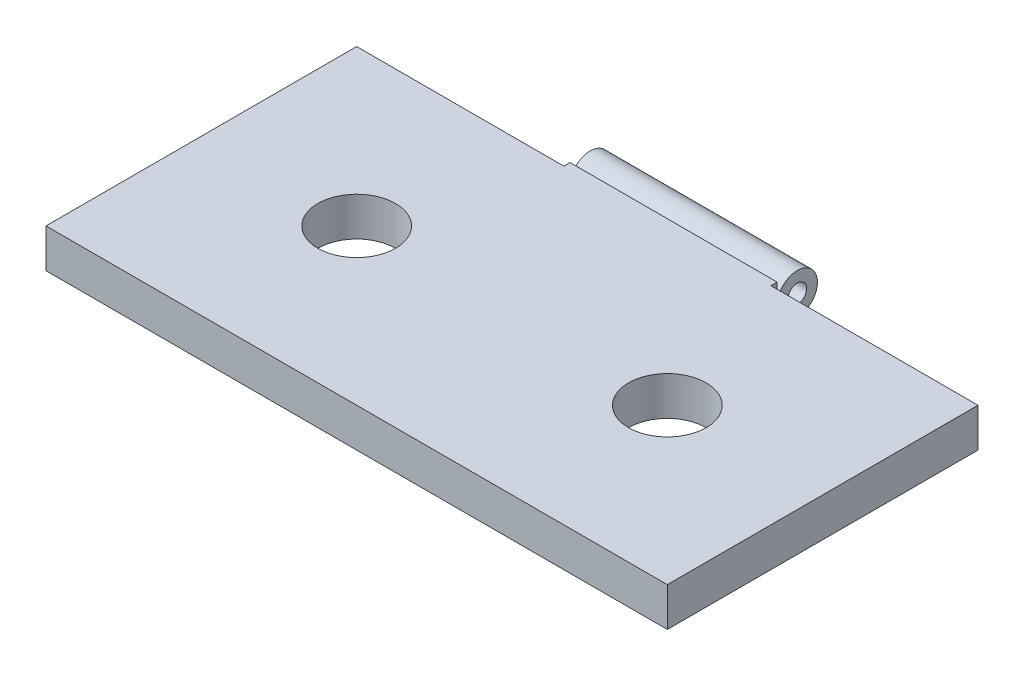
ISO-10303-21;
HEADER;
FILE_DESCRIPTION(('STEP AP214'),'2;1');
FILE_NAME('part.step','',(''),(''),'','','');
FILE_SCHEMA(('AUTOMOTIVE_DESIGN { 1 0 10303 214 1 1 1 1 }'));
ENDSEC;
DATA;
#1=APPLICATION_CONTEXT('core data for automotive mechanical design processes');
#2=APPLICATION_PROTOCOL_DEFINITION('international standard','automotive_design',2000,#1);
#3=PRODUCT_CONTEXT('',#1,'mechanical');
#4=PRODUCT('Part','Part','',(#3));
#5=PRODUCT_RELATED_PRODUCT_CATEGORY('part','',(#4));
#6=PRODUCT_DEFINITION_FORMATION('','',#4);
#7=PRODUCT_DEFINITION_CONTEXT('part definition',#1,'design');
#8=PRODUCT_DEFINITION('design','',#6,#7);
#9=PRODUCT_DEFINITION_SHAPE('','',#8);
#10=(LENGTH_UNIT() NAMED_UNIT(*) SI_UNIT(.MILLI.,.METRE.));
#11=(NAMED_UNIT(*) PLANE_ANGLE_UNIT() SI_UNIT($,.RADIAN.));
#12=(NAMED_UNIT(*) SI_UNIT($,.STERADIAN.) SOLID_ANGLE_UNIT());
#13=UNCERTAINTY_MEASURE_WITH_UNIT(LENGTH_MEASURE(1.E-05),#10,'distance_accuracy_value','');
#14=(GEOMETRIC_REPRESENTATION_CONTEXT(3) GLOBAL_UNCERTAINTY_ASSIGNED_CONTEXT((#13)) GLOBAL_UNIT_ASSIGNED_CONTEXT((#10,
#11,#12)) REPRESENTATION_CONTEXT('',''));
#15=CARTESIAN_POINT('',(0.,0.,0.));
#16=DIRECTION('',(0.,0.,1.));
#17=DIRECTION('',(1.,0.,0.));
#18=AXIS2_PLACEMENT_3D('',#15,#16,#17);
#19=CARTESIAN_POINT('',(25.4,3.175,-12.7));
#20=DIRECTION('',(0.,0.,1.));
#21=DIRECTION('',(1.,0.,0.));
#22=AXIS2_PLACEMENT_3D('',#19,#20,#21);
#23=PLANE('',#22);
#24=DIRECTION('',(0.,1.,0.));
#25=VECTOR('',#24,1.);
#26=CARTESIAN_POINT('',(-8.46666666666667,3.175,-12.7));
#27=LINE('',#26,#25);
#28=CARTESIAN_POINT('',(-8.46666666666666,0.,-12.7));
#29=VERTEX_POINT('',#28);
#30=CARTESIAN_POINT('',(-8.46666666666667,3.175,-12.7));
#31=VERTEX_POINT('',#30);
#32=EDGE_CURVE('E59',#29,#31,#27,.T.);
#33=ORIENTED_EDGE('',*,*,#32,.F.);
#34=DIRECTION('',(-1.,0.,0.));
#35=VECTOR('',#34,1.);
#36=CARTESIAN_POINT('',(25.4,0.,-12.7));
#37=LINE('',#36,#35);
#38=CARTESIAN_POINT('',(-25.4,0.,-12.7));
#39=VERTEX_POINT('',#38);
#40=EDGE_CURVE('E237',#29,#39,#37,.T.);
#41=ORIENTED_EDGE('',*,*,#40,.T.);
#42=DIRECTION('',(0.,-1.,0.));
#43=VECTOR('',#42,1.);
#44=CARTESIAN_POINT('',(-25.4,3.175,-12.7));
#45=LINE('',#44,#43);
#46=CARTESIAN_POINT('',(-25.4,3.175,-12.7));
#47=VERTEX_POINT('',#46);
#48=EDGE_CURVE('E127',#47,#39,#45,.T.);
#49=ORIENTED_EDGE('',*,*,#48,.F.);
#50=DIRECTION('',(-1.,0.,0.));
#51=VECTOR('',#50,1.);
#52=CARTESIAN_POINT('',(25.4,3.175,-12.7));
#53=LINE('',#52,#51);
#54=EDGE_CURVE('E124',#31,#47,#53,.T.);
#55=ORIENTED_EDGE('',*,*,#54,.F.);
#56=EDGE_LOOP('',(#33,#41,#49,#55));
#57=FACE_BOUND('',#56,.T.);
#58=ADVANCED_FACE('F34',(#57),#23,.F.);
#59=CARTESIAN_POINT('',(-25.4,3.175,-12.7));
#60=DIRECTION('',(0.,1.,0.));
#61=DIRECTION('',(0.,0.,1.));
#62=AXIS2_PLACEMENT_3D('',#59,#60,#61);
#63=PLANE('',#62);
#64=CARTESIAN_POINT('',(-12.7,3.175,0.));
#65=DIRECTION('',(0.,1.,0.));
#66=DIRECTION('',(0.,0.,1.));
#67=AXIS2_PLACEMENT_3D('',#64,#65,#66);
#68=CIRCLE('',#67,3.175);
#69=CARTESIAN_POINT('',(-12.7,3.175,3.175));
#70=VERTEX_POINT('',#69);
#71=EDGE_CURVE('E219',#70,#70,#68,.T.);
#72=ORIENTED_EDGE('',*,*,#71,.F.);
#73=EDGE_LOOP('',(#72));
#74=FACE_BOUND('',#73,.T.);
#75=DIRECTION('',(0.,0.,1.));
#76=VECTOR('',#75,1.);
#77=CARTESIAN_POINT('',(-25.4,3.175,12.7));
#78=LINE('',#77,#76);
#79=CARTESIAN_POINT('',(-25.4,3.175,12.7));
#80=VERTEX_POINT('',#79);
#81=EDGE_CURVE('E225',#47,#80,#78,.T.);
#82=ORIENTED_EDGE('',*,*,#81,.T.);
#83=DIRECTION('',(1.,0.,0.));
#84=VECTOR('',#83,1.);
#85=CARTESIAN_POINT('',(25.4,3.175,12.7));
#86=LINE('',#85,#84);
#87=CARTESIAN_POINT('',(25.4,3.175,12.7));
#88=VERTEX_POINT('',#87);
#89=EDGE_CURVE('E227',#80,#88,#86,.T.);
#90=ORIENTED_EDGE('',*,*,#89,.T.);
#91=DIRECTION('',(0.,0.,-1.));
#92=VECTOR('',#91,1.);
#93=CARTESIAN_POINT('',(25.4,3.175,12.7));
#94=LINE('',#93,#92);
#95=CARTESIAN_POINT('',(25.4,3.175,-12.7));
#96=VERTEX_POINT('',#95);
#97=EDGE_CURVE('E132',#88,#96,#94,.T.);
#98=ORIENTED_EDGE('',*,*,#97,.T.);
#99=CARTESIAN_POINT('',(8.46666666666667,3.175,-12.7));
#100=VERTEX_POINT('',#99);
#101=EDGE_CURVE('E131',#96,#100,#53,.T.);
#102=ORIENTED_EDGE('',*,*,#101,.T.);
#103=DIRECTION('',(0.,0.,-1.));
#104=VECTOR('',#103,1.);
#105=CARTESIAN_POINT('',(8.46666666666667,3.175,-12.7));
#106=LINE('',#105,#104);
#107=CARTESIAN_POINT('',(8.46666666666667,3.175,-13.208));
#108=VERTEX_POINT('',#107);
#109=EDGE_CURVE('E179',#100,#108,#106,.T.);
#110=ORIENTED_EDGE('',*,*,#109,.T.);
#111=DIRECTION('',(1.,0.,0.));
#112=VECTOR('',#111,1.);
#113=CARTESIAN_POINT('',(-8.46666666666667,3.175,-13.208));
#114=LINE('',#113,#112);
#115=CARTESIAN_POINT('',(-8.46666666666667,3.175,-13.208));
#116=VERTEX_POINT('',#115);
#117=EDGE_CURVE('E139',#116,#108,#114,.T.);
#118=ORIENTED_EDGE('',*,*,#117,.F.);
#119=DIRECTION('',(0.,0.,-1.));
#120=VECTOR('',#119,1.);
#121=CARTESIAN_POINT('',(-8.46666666666667,3.175,-12.7));
#122=LINE('',#121,#120);
#123=EDGE_CURVE('E135',#31,#116,#122,.T.);
#124=ORIENTED_EDGE('',*,*,#123,.F.);
#125=ORIENTED_EDGE('',*,*,#54,.T.);
#126=EDGE_LOOP('',(#82,#90,#98,#102,#110,#118,#124,#125));
#127=FACE_BOUND('',#126,.T.);
#128=CARTESIAN_POINT('',(12.7,3.175,0.));
#129=DIRECTION('',(0.,1.,0.));
#130=DIRECTION('',(0.,0.,1.));
#131=AXIS2_PLACEMENT_3D('',#128,#129,#130);
#132=CIRCLE('',#131,3.175);
#133=CARTESIAN_POINT('',(12.7,3.175,3.175));
#134=VERTEX_POINT('',#133);
#135=EDGE_CURVE('E213',#134,#134,#132,.T.);
#136=ORIENTED_EDGE('',*,*,#135,.F.);
#137=EDGE_LOOP('',(#136));
#138=FACE_BOUND('',#137,.T.);
#139=ADVANCED_FACE('F136',(#74,#127,#138),#63,.T.);
#140=CARTESIAN_POINT('',(-25.4,0.,-12.7));
#141=DIRECTION('',(0.,1.,0.));
#142=DIRECTION('',(0.,0.,1.));
#143=AXIS2_PLACEMENT_3D('',#140,#141,#142);
#144=PLANE('',#143);
#145=CARTESIAN_POINT('',(-12.7,0.,0.));
#146=DIRECTION('',(0.,1.,0.));
#147=DIRECTION('',(0.,0.,1.));
#148=AXIS2_PLACEMENT_3D('',#145,#146,#147);
#149=CIRCLE('',#148,3.175);
#150=CARTESIAN_POINT('',(-12.7,0.,3.175));
#151=VERTEX_POINT('',#150);
#152=EDGE_CURVE('E216',#151,#151,#149,.T.);
#153=ORIENTED_EDGE('',*,*,#152,.T.);
#154=EDGE_LOOP('',(#153));
#155=FACE_BOUND('',#154,.T.);
#156=DIRECTION('',(0.,0.,1.));
#157=VECTOR('',#156,1.);
#158=CARTESIAN_POINT('',(-25.4,0.,12.7));
#159=LINE('',#158,#157);
#160=CARTESIAN_POINT('',(-25.4,0.,12.7));
#161=VERTEX_POINT('',#160);
#162=EDGE_CURVE('E222',#39,#161,#159,.T.);
#163=ORIENTED_EDGE('',*,*,#162,.F.);
#164=ORIENTED_EDGE('',*,*,#40,.F.);
#165=DIRECTION('',(0.,0.,1.));
#166=VECTOR('',#165,1.);
#167=CARTESIAN_POINT('',(-8.46666666666667,0.,-12.7));
#168=LINE('',#167,#166);
#169=CARTESIAN_POINT('',(-8.46666666666667,0.,-13.208));
#170=VERTEX_POINT('',#169);
#171=EDGE_CURVE('E148',#170,#29,#168,.T.);
#172=ORIENTED_EDGE('',*,*,#171,.F.);
#173=DIRECTION('',(1.,0.,0.));
#174=VECTOR('',#173,1.);
#175=CARTESIAN_POINT('',(-8.46666666666667,0.,-13.208));
#176=LINE('',#175,#174);
#177=CARTESIAN_POINT('',(8.46666666666667,0.,-13.208));
#178=VERTEX_POINT('',#177);
#179=EDGE_CURVE('E198',#170,#178,#176,.T.);
#180=ORIENTED_EDGE('',*,*,#179,.T.);
#181=DIRECTION('',(0.,0.,1.));
#182=VECTOR('',#181,1.);
#183=CARTESIAN_POINT('',(8.46666666666667,0.,-12.7));
#184=LINE('',#183,#182);
#185=CARTESIAN_POINT('',(8.46666666666667,0.,-12.7));
#186=VERTEX_POINT('',#185);
#187=EDGE_CURVE('E149',#178,#186,#184,.T.);
#188=ORIENTED_EDGE('',*,*,#187,.T.);
#189=CARTESIAN_POINT('',(25.4,0.,-12.7));
#190=VERTEX_POINT('',#189);
#191=EDGE_CURVE('E228',#190,#186,#37,.T.);
#192=ORIENTED_EDGE('',*,*,#191,.F.);
#193=DIRECTION('',(0.,0.,-1.));
#194=VECTOR('',#193,1.);
#195=CARTESIAN_POINT('',(25.4,0.,12.7));
#196=LINE('',#195,#194);
#197=CARTESIAN_POINT('',(25.4,0.,12.7));
#198=VERTEX_POINT('',#197);
#199=EDGE_CURVE('E240',#198,#190,#196,.T.);
#200=ORIENTED_EDGE('',*,*,#199,.F.);
#201=DIRECTION('',(1.,0.,0.));
#202=VECTOR('',#201,1.);
#203=CARTESIAN_POINT('',(25.4,0.,12.7));
#204=LINE('',#203,#202);
#205=EDGE_CURVE('E262',#161,#198,#204,.T.);
#206=ORIENTED_EDGE('',*,*,#205,.F.);
#207=EDGE_LOOP('',(#163,#164,#172,#180,#188,#192,#200,#206));
#208=FACE_BOUND('',#207,.T.);
#209=CARTESIAN_POINT('',(12.7,0.,0.));
#210=DIRECTION('',(0.,1.,0.));
#211=DIRECTION('',(0.,0.,1.));
#212=AXIS2_PLACEMENT_3D('',#209,#210,#211);
#213=CIRCLE('',#212,3.175);
#214=CARTESIAN_POINT('',(12.7,0.,3.175));
#215=VERTEX_POINT('',#214);
#216=EDGE_CURVE('E212',#215,#215,#213,.T.);
#217=ORIENTED_EDGE('',*,*,#216,.T.);
#218=EDGE_LOOP('',(#217));
#219=FACE_BOUND('',#218,.T.);
#220=ADVANCED_FACE('F260',(#155,#208,#219),#144,.F.);
#221=CARTESIAN_POINT('',(-25.4,3.175,12.7));
#222=DIRECTION('',(1.,0.,0.));
#223=DIRECTION('',(0.,0.,-1.));
#224=AXIS2_PLACEMENT_3D('',#221,#222,#223);
#225=PLANE('',#224);
#226=ORIENTED_EDGE('',*,*,#162,.T.);
#227=DIRECTION('',(0.,-1.,0.));
#228=VECTOR('',#227,1.);
#229=CARTESIAN_POINT('',(-25.4,3.175,12.7));
#230=LINE('',#229,#228);
#231=EDGE_CURVE('E11',#80,#161,#230,.T.);
#232=ORIENTED_EDGE('',*,*,#231,.F.);
#233=ORIENTED_EDGE('',*,*,#81,.F.);
#234=ORIENTED_EDGE('',*,*,#48,.T.);
#235=EDGE_LOOP('',(#226,#232,#233,#234));
#236=FACE_BOUND('',#235,.T.);
#237=ADVANCED_FACE('F36',(#236),#225,.F.);
#238=CARTESIAN_POINT('',(25.4,3.175,12.7));
#239=DIRECTION('',(0.,0.,-1.));
#240=DIRECTION('',(-1.,0.,0.));
#241=AXIS2_PLACEMENT_3D('',#238,#239,#240);
#242=PLANE('',#241);
#243=ORIENTED_EDGE('',*,*,#205,.T.);
#244=DIRECTION('',(0.,-1.,0.));
#245=VECTOR('',#244,1.);
#246=CARTESIAN_POINT('',(25.4,3.175,12.7));
#247=LINE('',#246,#245);
#248=EDGE_CURVE('E43',#88,#198,#247,.T.);
#249=ORIENTED_EDGE('',*,*,#248,.F.);
#250=ORIENTED_EDGE('',*,*,#89,.F.);
#251=ORIENTED_EDGE('',*,*,#231,.T.);
#252=EDGE_LOOP('',(#243,#249,#250,#251));
#253=FACE_BOUND('',#252,.T.);
#254=ADVANCED_FACE('F314',(#253),#242,.F.);
#255=CARTESIAN_POINT('',(25.4,3.175,12.7));
#256=DIRECTION('',(-1.,0.,0.));
#257=DIRECTION('',(0.,0.,1.));
#258=AXIS2_PLACEMENT_3D('',#255,#256,#257);
#259=PLANE('',#258);
#260=ORIENTED_EDGE('',*,*,#199,.T.);
#261=DIRECTION('',(0.,-1.,0.));
#262=VECTOR('',#261,1.);
#263=CARTESIAN_POINT('',(25.4,3.175,-12.7));
#264=LINE('',#263,#262);
#265=EDGE_CURVE('E246',#96,#190,#264,.T.);
#266=ORIENTED_EDGE('',*,*,#265,.F.);
#267=ORIENTED_EDGE('',*,*,#97,.F.);
#268=ORIENTED_EDGE('',*,*,#248,.T.);
#269=EDGE_LOOP('',(#260,#266,#267,#268));
#270=FACE_BOUND('',#269,.T.);
#271=ADVANCED_FACE('F254',(#270),#259,.F.);
#272=ORIENTED_EDGE('',*,*,#191,.T.);
#273=DIRECTION('',(0.,1.,0.));
#274=VECTOR('',#273,1.);
#275=CARTESIAN_POINT('',(8.46666666666667,3.175,-12.7));
#276=LINE('',#275,#274);
#277=EDGE_CURVE('E51',#186,#100,#276,.T.);
#278=ORIENTED_EDGE('',*,*,#277,.T.);
#279=ORIENTED_EDGE('',*,*,#101,.F.);
#280=ORIENTED_EDGE('',*,*,#265,.T.);
#281=EDGE_LOOP('',(#272,#278,#279,#280));
#282=FACE_BOUND('',#281,.T.);
#283=ADVANCED_FACE('F297',(#282),#23,.F.);
#284=CARTESIAN_POINT('',(-12.7,3.175,0.));
#285=DIRECTION('',(0.,-1.,0.));
#286=DIRECTION('',(0.,0.,-1.));
#287=AXIS2_PLACEMENT_3D('',#284,#285,#286);
#288=CYLINDRICAL_SURFACE('',#287,3.175);
#289=ORIENTED_EDGE('',*,*,#71,.T.);
#290=EDGE_LOOP('',(#289));
#291=FACE_BOUND('',#290,.T.);
#292=ORIENTED_EDGE('',*,*,#152,.F.);
#293=EDGE_LOOP('',(#292));
#294=FACE_BOUND('',#293,.T.);
#295=ADVANCED_FACE('F306',(#291,#294),#288,.F.);
#296=CARTESIAN_POINT('',(12.7,3.175,0.));
#297=DIRECTION('',(0.,-1.,0.));
#298=DIRECTION('',(0.,0.,-1.));
#299=AXIS2_PLACEMENT_3D('',#296,#297,#298);
#300=CYLINDRICAL_SURFACE('',#299,3.175);
#301=ORIENTED_EDGE('',*,*,#135,.T.);
#302=EDGE_LOOP('',(#301));
#303=FACE_BOUND('',#302,.T.);
#304=ORIENTED_EDGE('',*,*,#216,.F.);
#305=EDGE_LOOP('',(#304));
#306=FACE_BOUND('',#305,.T.);
#307=ADVANCED_FACE('F311',(#303,#306),#300,.F.);
#308=CARTESIAN_POINT('',(-8.46666666666667,0.605877450805559,-13.335));
#309=DIRECTION('',(-1.,0.,0.));
#310=DIRECTION('',(0.,0.,1.));
#311=AXIS2_PLACEMENT_3D('',#308,#309,#310);
#312=PLANE('',#311);
#313=ORIENTED_EDGE('',*,*,#32,.T.);
#314=ORIENTED_EDGE('',*,*,#123,.T.);
#315=DIRECTION('',(0.,-1.,0.));
#316=VECTOR('',#315,1.);
#317=CARTESIAN_POINT('',(-8.46666666666667,3.175,-13.208));
#318=LINE('',#317,#316);
#319=CARTESIAN_POINT('',(-8.46666666666667,2.43749749874126,-13.208));
#320=VERTEX_POINT('',#319);
#321=EDGE_CURVE('E142',#116,#320,#318,.T.);
#322=ORIENTED_EDGE('',*,*,#321,.T.);
#323=CARTESIAN_POINT('',(-8.46666666666667,2.43749749874126,-13.335));
#324=DIRECTION('',(1.,0.,0.));
#325=DIRECTION('',(0.,0.,1.));
#326=AXIS2_PLACEMENT_3D('',#323,#324,#325);
#327=CIRCLE('',#326,0.127);
#328=CARTESIAN_POINT('',(-8.46666666666667,2.37208249702927,-13.4438571428571));
#329=VERTEX_POINT('',#328);
#330=EDGE_CURVE('E165',#320,#329,#327,.T.);
#331=ORIENTED_EDGE('',*,*,#330,.T.);
#332=CARTESIAN_POINT('',(-8.46666666666667,1.52168747477341,-14.859));
#333=DIRECTION('',(-1.,0.,0.));
#334=DIRECTION('',(0.,0.,1.));
#335=AXIS2_PLACEMENT_3D('',#332,#333,#334);
#336=CIRCLE('',#335,1.651);
#337=CARTESIAN_POINT('',(-8.46666666666667,0.671292452517548,-13.4438571428571));
#338=VERTEX_POINT('',#337);
#339=EDGE_CURVE('E167',#329,#338,#336,.T.);
#340=ORIENTED_EDGE('',*,*,#339,.T.);
#341=CARTESIAN_POINT('',(-8.46666666666667,0.605877450805559,-13.335));
#342=DIRECTION('',(1.,0.,0.));
#343=DIRECTION('',(0.,0.,1.));
#344=AXIS2_PLACEMENT_3D('',#341,#342,#343);
#345=CIRCLE('',#344,0.127);
#346=CARTESIAN_POINT('',(-8.46666666666667,0.605877450805559,-13.208));
#347=VERTEX_POINT('',#346);
#348=EDGE_CURVE('E169',#338,#347,#345,.T.);
#349=ORIENTED_EDGE('',*,*,#348,.T.);
#350=DIRECTION('',(0.,-1.,0.));
#351=VECTOR('',#350,1.);
#352=CARTESIAN_POINT('',(-8.46666666666667,0.605877450805559,-13.208));
#353=LINE('',#352,#351);
#354=EDGE_CURVE('E171',#347,#170,#353,.T.);
#355=ORIENTED_EDGE('',*,*,#354,.T.);
#356=ORIENTED_EDGE('',*,*,#171,.T.);
#357=EDGE_LOOP('',(#313,#314,#322,#331,#340,#349,#355,#356));
#358=FACE_BOUND('',#357,.T.);
#359=CARTESIAN_POINT('',(-8.46666666666667,1.52168747477341,-14.859));
#360=DIRECTION('',(-1.,0.,0.));
#361=DIRECTION('',(0.,0.,1.));
#362=AXIS2_PLACEMENT_3D('',#359,#360,#361);
#363=CIRCLE('',#362,0.762000000000001);
#364=CARTESIAN_POINT('',(-8.46666666666667,1.52168747477341,-14.097));
#365=VERTEX_POINT('',#364);
#366=EDGE_CURVE('E180',#365,#365,#363,.T.);
#367=ORIENTED_EDGE('',*,*,#366,.F.);
#368=EDGE_LOOP('',(#367));
#369=FACE_BOUND('',#368,.T.);
#370=ADVANCED_FACE('F145',(#358,#369),#312,.T.);
#371=CARTESIAN_POINT('',(8.46666666666667,0.605877450805559,-13.335));
#372=DIRECTION('',(-1.,0.,0.));
#373=DIRECTION('',(0.,0.,1.));
#374=AXIS2_PLACEMENT_3D('',#371,#372,#373);
#375=PLANE('',#374);
#376=ORIENTED_EDGE('',*,*,#277,.F.);
#377=ORIENTED_EDGE('',*,*,#187,.F.);
#378=DIRECTION('',(0.,-1.,0.));
#379=VECTOR('',#378,1.);
#380=CARTESIAN_POINT('',(8.46666666666667,0.605877450805559,-13.208));
#381=LINE('',#380,#379);
#382=CARTESIAN_POINT('',(8.46666666666667,0.605877450805559,-13.208));
#383=VERTEX_POINT('',#382);
#384=EDGE_CURVE('E152',#383,#178,#381,.T.);
#385=ORIENTED_EDGE('',*,*,#384,.F.);
#386=CARTESIAN_POINT('',(8.46666666666667,0.605877450805559,-13.335));
#387=DIRECTION('',(1.,0.,0.));
#388=DIRECTION('',(0.,0.,1.));
#389=AXIS2_PLACEMENT_3D('',#386,#387,#388);
#390=CIRCLE('',#389,0.127);
#391=CARTESIAN_POINT('',(8.46666666666667,0.671292452517548,-13.4438571428571));
#392=VERTEX_POINT('',#391);
#393=EDGE_CURVE('E193',#392,#383,#390,.T.);
#394=ORIENTED_EDGE('',*,*,#393,.F.);
#395=CARTESIAN_POINT('',(8.46666666666667,1.52168747477341,-14.859));
#396=DIRECTION('',(-1.,0.,0.));
#397=DIRECTION('',(0.,0.,1.));
#398=AXIS2_PLACEMENT_3D('',#395,#396,#397);
#399=CIRCLE('',#398,1.651);
#400=CARTESIAN_POINT('',(8.46666666666667,2.37208249702927,-13.4438571428571));
#401=VERTEX_POINT('',#400);
#402=EDGE_CURVE('E188',#401,#392,#399,.T.);
#403=ORIENTED_EDGE('',*,*,#402,.F.);
#404=CARTESIAN_POINT('',(8.46666666666667,2.43749749874126,-13.335));
#405=DIRECTION('',(1.,0.,0.));
#406=DIRECTION('',(0.,0.,1.));
#407=AXIS2_PLACEMENT_3D('',#404,#405,#406);
#408=CIRCLE('',#407,0.127);
#409=CARTESIAN_POINT('',(8.46666666666667,2.43749749874126,-13.208));
#410=VERTEX_POINT('',#409);
#411=EDGE_CURVE('E183',#410,#401,#408,.T.);
#412=ORIENTED_EDGE('',*,*,#411,.F.);
#413=DIRECTION('',(0.,-1.,0.));
#414=VECTOR('',#413,1.);
#415=CARTESIAN_POINT('',(8.46666666666667,3.175,-13.208));
#416=LINE('',#415,#414);
#417=EDGE_CURVE('E175',#108,#410,#416,.T.);
#418=ORIENTED_EDGE('',*,*,#417,.F.);
#419=ORIENTED_EDGE('',*,*,#109,.F.);
#420=EDGE_LOOP('',(#376,#377,#385,#394,#403,#412,#418,#419));
#421=FACE_BOUND('',#420,.T.);
#422=CARTESIAN_POINT('',(8.46666666666667,1.52168747477341,-14.859));
#423=DIRECTION('',(-1.,0.,0.));
#424=DIRECTION('',(0.,0.,1.));
#425=AXIS2_PLACEMENT_3D('',#422,#423,#424);
#426=CIRCLE('',#425,0.762000000000001);
#427=CARTESIAN_POINT('',(8.46666666666667,1.52168747477341,-14.097));
#428=VERTEX_POINT('',#427);
#429=EDGE_CURVE('E162',#428,#428,#426,.T.);
#430=ORIENTED_EDGE('',*,*,#429,.T.);
#431=EDGE_LOOP('',(#430));
#432=FACE_BOUND('',#431,.T.);
#433=ADVANCED_FACE('F272',(#421,#432),#375,.F.);
#434=CARTESIAN_POINT('',(-8.46666666666667,3.175,-13.208));
#435=DIRECTION('',(0.,0.,1.));
#436=DIRECTION('',(1.,0.,0.));
#437=AXIS2_PLACEMENT_3D('',#434,#435,#436);
#438=PLANE('',#437);
#439=ORIENTED_EDGE('',*,*,#417,.T.);
#440=DIRECTION('',(1.,0.,0.));
#441=VECTOR('',#440,1.);
#442=CARTESIAN_POINT('',(-8.46666666666667,2.43749749874126,-13.208));
#443=LINE('',#442,#441);
#444=EDGE_CURVE('E209',#320,#410,#443,.T.);
#445=ORIENTED_EDGE('',*,*,#444,.F.);
#446=ORIENTED_EDGE('',*,*,#321,.F.);
#447=ORIENTED_EDGE('',*,*,#117,.T.);
#448=EDGE_LOOP('',(#439,#445,#446,#447));
#449=FACE_BOUND('',#448,.T.);
#450=ADVANCED_FACE('F287',(#449),#438,.F.);
#451=CARTESIAN_POINT('',(-8.46666666666667,2.43749749874126,-13.335));
#452=DIRECTION('',(1.,0.,0.));
#453=DIRECTION('',(0.,0.,-1.));
#454=AXIS2_PLACEMENT_3D('',#451,#452,#453);
#455=CYLINDRICAL_SURFACE('',#454,0.127);
#456=ORIENTED_EDGE('',*,*,#411,.T.);
#457=DIRECTION('',(1.,0.,0.));
#458=VECTOR('',#457,1.);
#459=CARTESIAN_POINT('',(-8.46666666666667,2.37208249702927,-13.4438571428571));
#460=LINE('',#459,#458);
#461=EDGE_CURVE('E207',#329,#401,#460,.T.);
#462=ORIENTED_EDGE('',*,*,#461,.F.);
#463=ORIENTED_EDGE('',*,*,#330,.F.);
#464=ORIENTED_EDGE('',*,*,#444,.T.);
#465=EDGE_LOOP('',(#456,#462,#463,#464));
#466=FACE_BOUND('',#465,.T.);
#467=ADVANCED_FACE('F285',(#466),#455,.F.);
#468=CARTESIAN_POINT('',(-8.46666666666667,1.52168747477341,-14.859));
#469=DIRECTION('',(1.,0.,0.));
#470=DIRECTION('',(0.,0.,-1.));
#471=AXIS2_PLACEMENT_3D('',#468,#469,#470);
#472=CYLINDRICAL_SURFACE('',#471,1.651);
#473=ORIENTED_EDGE('',*,*,#402,.T.);
#474=DIRECTION('',(1.,0.,0.));
#475=VECTOR('',#474,1.);
#476=CARTESIAN_POINT('',(-8.46666666666667,0.671292452517548,-13.4438571428571));
#477=LINE('',#476,#475);
#478=EDGE_CURVE('E204',#338,#392,#477,.T.);
#479=ORIENTED_EDGE('',*,*,#478,.F.);
#480=ORIENTED_EDGE('',*,*,#339,.F.);
#481=ORIENTED_EDGE('',*,*,#461,.T.);
#482=EDGE_LOOP('',(#473,#479,#480,#481));
#483=FACE_BOUND('',#482,.T.);
#484=ADVANCED_FACE('F278',(#483),#472,.T.);
#485=CARTESIAN_POINT('',(-8.46666666666667,0.605877450805559,-13.335));
#486=DIRECTION('',(1.,0.,0.));
#487=DIRECTION('',(0.,0.,-1.));
#488=AXIS2_PLACEMENT_3D('',#485,#486,#487);
#489=CYLINDRICAL_SURFACE('',#488,0.127);
#490=ORIENTED_EDGE('',*,*,#393,.T.);
#491=DIRECTION('',(1.,0.,0.));
#492=VECTOR('',#491,1.);
#493=CARTESIAN_POINT('',(-8.46666666666667,0.605877450805559,-13.208));
#494=LINE('',#493,#492);
#495=EDGE_CURVE('E201',#347,#383,#494,.T.);
#496=ORIENTED_EDGE('',*,*,#495,.F.);
#497=ORIENTED_EDGE('',*,*,#348,.F.);
#498=ORIENTED_EDGE('',*,*,#478,.T.);
#499=EDGE_LOOP('',(#490,#496,#497,#498));
#500=FACE_BOUND('',#499,.T.);
#501=ADVANCED_FACE('F282',(#500),#489,.F.);
#502=CARTESIAN_POINT('',(-8.46666666666667,0.605877450805559,-13.208));
#503=DIRECTION('',(0.,0.,1.));
#504=DIRECTION('',(1.,0.,0.));
#505=AXIS2_PLACEMENT_3D('',#502,#503,#504);
#506=PLANE('',#505);
#507=ORIENTED_EDGE('',*,*,#384,.T.);
#508=ORIENTED_EDGE('',*,*,#179,.F.);
#509=ORIENTED_EDGE('',*,*,#354,.F.);
#510=ORIENTED_EDGE('',*,*,#495,.T.);
#511=EDGE_LOOP('',(#507,#508,#509,#510));
#512=FACE_BOUND('',#511,.T.);
#513=ADVANCED_FACE('F342',(#512),#506,.F.);
#514=CARTESIAN_POINT('',(-8.46666666666667,1.52168747477341,-14.859));
#515=DIRECTION('',(1.,0.,0.));
#516=DIRECTION('',(0.,0.,-1.));
#517=AXIS2_PLACEMENT_3D('',#514,#515,#516);
#518=CYLINDRICAL_SURFACE('',#517,0.762000000000001);
#519=ORIENTED_EDGE('',*,*,#366,.T.);
#520=EDGE_LOOP('',(#519));
#521=FACE_BOUND('',#520,.T.);
#522=ORIENTED_EDGE('',*,*,#429,.F.);
#523=EDGE_LOOP('',(#522));
#524=FACE_BOUND('',#523,.T.);
#525=ADVANCED_FACE('F340',(#521,#524),#518,.F.);
#526=CLOSED_SHELL('',(#58,#139,#220,#237,#254,#271,#283,#295,#307,#370,#433,#450,#467,#484,#501,
#513,#525));
#527=MANIFOLD_SOLID_BREP('B2',#526);
#528=ADVANCED_BREP_SHAPE_REPRESENTATION('',(#18,#527),#14);
#529=SHAPE_DEFINITION_REPRESENTATION(#9,#528);
ENDSEC;
END-ISO-10303-21;
